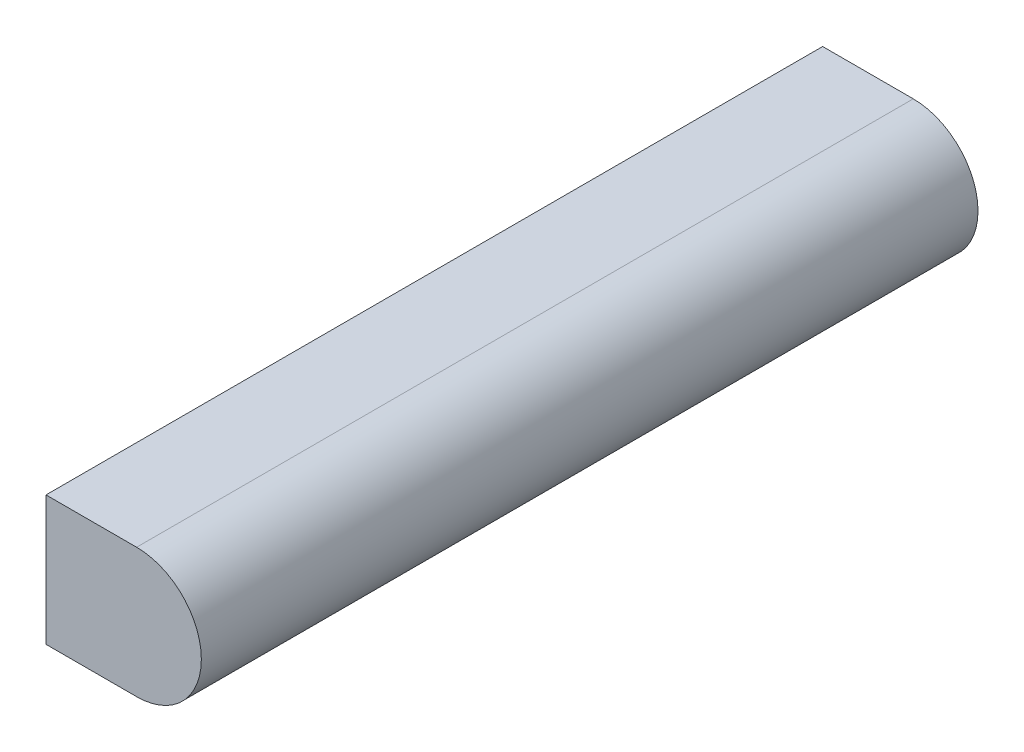
ISO-10303-21;
HEADER;
FILE_DESCRIPTION(('STEP AP214'),'2;1');
FILE_NAME('part.step','',(''),(''),'','','');
FILE_SCHEMA(('AUTOMOTIVE_DESIGN { 1 0 10303 214 1 1 1 1 }'));
ENDSEC;
DATA;
#1=APPLICATION_CONTEXT('core data for automotive mechanical design processes');
#2=APPLICATION_PROTOCOL_DEFINITION('international standard','automotive_design',2000,#1);
#3=PRODUCT_CONTEXT('',#1,'mechanical');
#4=PRODUCT('Part','Part','',(#3));
#5=PRODUCT_RELATED_PRODUCT_CATEGORY('part','',(#4));
#6=PRODUCT_DEFINITION_FORMATION('','',#4);
#7=PRODUCT_DEFINITION_CONTEXT('part definition',#1,'design');
#8=PRODUCT_DEFINITION('design','',#6,#7);
#9=PRODUCT_DEFINITION_SHAPE('','',#8);
#10=(LENGTH_UNIT() NAMED_UNIT(*) SI_UNIT(.MILLI.,.METRE.));
#11=(NAMED_UNIT(*) PLANE_ANGLE_UNIT() SI_UNIT($,.RADIAN.));
#12=(NAMED_UNIT(*) SI_UNIT($,.STERADIAN.) SOLID_ANGLE_UNIT());
#13=UNCERTAINTY_MEASURE_WITH_UNIT(LENGTH_MEASURE(1.E-05),#10,'distance_accuracy_value','');
#14=(GEOMETRIC_REPRESENTATION_CONTEXT(3) GLOBAL_UNCERTAINTY_ASSIGNED_CONTEXT((#13)) GLOBAL_UNIT_ASSIGNED_CONTEXT((#10,
#11,#12)) REPRESENTATION_CONTEXT('',''));
#15=CARTESIAN_POINT('',(0.,0.,0.));
#16=DIRECTION('',(0.,0.,1.));
#17=DIRECTION('',(1.,0.,0.));
#18=AXIS2_PLACEMENT_3D('',#15,#16,#17);
#19=CARTESIAN_POINT('',(3.175,3.17600000000064,0.));
#20=DIRECTION('',(-0.999999950399905,-0.000314960614369364,0.));
#21=DIRECTION('',(0.000314960614369364,-0.999999950399905,0.));
#22=AXIS2_PLACEMENT_3D('',#19,#20,#21);
#23=PLANE('',#22);
#24=DIRECTION('',(0.000314960614369364,-0.999999950399905,0.));
#25=VECTOR('',#24,1.);
#26=CARTESIAN_POINT('',(3.175,3.17600000000064,38.1));
#27=LINE('',#26,#25);
#28=CARTESIAN_POINT('',(3.175,3.17600000000064,38.1));
#29=VERTEX_POINT('',#28);
#30=CARTESIAN_POINT('',(3.17700000000044,-3.17399999999937,38.1));
#31=VERTEX_POINT('',#30);
#32=EDGE_CURVE('E107',#29,#31,#27,.T.);
#33=ORIENTED_EDGE('',*,*,#32,.F.);
#34=DIRECTION('',(0.,0.,1.));
#35=VECTOR('',#34,1.);
#36=CARTESIAN_POINT('',(3.175,3.17600000000064,0.));
#37=LINE('',#36,#35);
#38=CARTESIAN_POINT('',(3.175,3.17600000000064,0.));
#39=VERTEX_POINT('',#38);
#40=EDGE_CURVE('E11',#39,#29,#37,.T.);
#41=ORIENTED_EDGE('',*,*,#40,.F.);
#42=DIRECTION('',(0.000314960614369364,-0.999999950399905,0.));
#43=VECTOR('',#42,1.);
#44=CARTESIAN_POINT('',(3.175,3.17600000000064,0.));
#45=LINE('',#44,#43);
#46=CARTESIAN_POINT('',(3.17700000000044,-3.17399999999937,0.));
#47=VERTEX_POINT('',#46);
#48=EDGE_CURVE('E98',#39,#47,#45,.T.);
#49=ORIENTED_EDGE('',*,*,#48,.T.);
#50=DIRECTION('',(0.,0.,1.));
#51=VECTOR('',#50,1.);
#52=CARTESIAN_POINT('',(3.17700000000044,-3.17399999999937,0.));
#53=LINE('',#52,#51);
#54=EDGE_CURVE('E39',#47,#31,#53,.T.);
#55=ORIENTED_EDGE('',*,*,#54,.T.);
#56=EDGE_LOOP('',(#33,#41,#49,#55));
#57=FACE_BOUND('',#56,.T.);
#58=ADVANCED_FACE('F36',(#57),#23,.T.);
#59=CARTESIAN_POINT('',(3.175,3.17600000000064,0.));
#60=DIRECTION('',(0.,1.,0.));
#61=DIRECTION('',(0.,0.,1.));
#62=AXIS2_PLACEMENT_3D('',#59,#60,#61);
#63=PLANE('',#62);
#64=DIRECTION('',(-1.,0.,0.));
#65=VECTOR('',#64,1.);
#66=CARTESIAN_POINT('',(3.175,3.17600000000064,38.1));
#67=LINE('',#66,#65);
#68=CARTESIAN_POINT('',(7.62099999999846,3.17600000000064,38.1));
#69=VERTEX_POINT('',#68);
#70=EDGE_CURVE('E102',#69,#29,#67,.T.);
#71=ORIENTED_EDGE('',*,*,#70,.F.);
#72=DIRECTION('',(0.,0.,1.));
#73=VECTOR('',#72,1.);
#74=CARTESIAN_POINT('',(7.62099999999846,3.17600000000064,0.));
#75=LINE('',#74,#73);
#76=CARTESIAN_POINT('',(7.62099999999846,3.17600000000064,0.));
#77=VERTEX_POINT('',#76);
#78=EDGE_CURVE('E46',#77,#69,#75,.T.);
#79=ORIENTED_EDGE('',*,*,#78,.F.);
#80=DIRECTION('',(-1.,0.,0.));
#81=VECTOR('',#80,1.);
#82=CARTESIAN_POINT('',(3.175,3.17600000000064,0.));
#83=LINE('',#82,#81);
#84=EDGE_CURVE('E93',#77,#39,#83,.T.);
#85=ORIENTED_EDGE('',*,*,#84,.T.);
#86=ORIENTED_EDGE('',*,*,#40,.T.);
#87=EDGE_LOOP('',(#71,#79,#85,#86));
#88=FACE_BOUND('',#87,.T.);
#89=ADVANCED_FACE('F122',(#88),#63,.T.);
#90=CARTESIAN_POINT('',(7.62099999999923,0.00100000000063417,0.));
#91=DIRECTION('',(0.,0.,1.));
#92=DIRECTION('',(1.,0.,0.));
#93=AXIS2_PLACEMENT_3D('',#90,#91,#92);
#94=CYLINDRICAL_SURFACE('',#93,3.175);
#95=CARTESIAN_POINT('',(7.62099999999923,0.00100000000063417,38.1));
#96=DIRECTION('',(0.,0.,1.));
#97=DIRECTION('',(1.,0.,0.));
#98=AXIS2_PLACEMENT_3D('',#95,#96,#97);
#99=CIRCLE('',#98,3.175);
#100=CARTESIAN_POINT('',(7.62099999999999,-3.17399999999937,38.1));
#101=VERTEX_POINT('',#100);
#102=EDGE_CURVE('E87',#101,#69,#99,.T.);
#103=ORIENTED_EDGE('',*,*,#102,.F.);
#104=DIRECTION('',(0.,0.,1.));
#105=VECTOR('',#104,1.);
#106=CARTESIAN_POINT('',(7.62099999999999,-3.17399999999937,0.));
#107=LINE('',#106,#105);
#108=CARTESIAN_POINT('',(7.62099999999999,-3.17399999999937,0.));
#109=VERTEX_POINT('',#108);
#110=EDGE_CURVE('E82',#109,#101,#107,.T.);
#111=ORIENTED_EDGE('',*,*,#110,.F.);
#112=CARTESIAN_POINT('',(7.62099999999923,0.00100000000063417,0.));
#113=DIRECTION('',(0.,0.,1.));
#114=DIRECTION('',(1.,0.,0.));
#115=AXIS2_PLACEMENT_3D('',#112,#113,#114);
#116=CIRCLE('',#115,3.175);
#117=EDGE_CURVE('E85',#109,#77,#116,.T.);
#118=ORIENTED_EDGE('',*,*,#117,.T.);
#119=ORIENTED_EDGE('',*,*,#78,.T.);
#120=EDGE_LOOP('',(#103,#111,#118,#119));
#121=FACE_BOUND('',#120,.T.);
#122=ADVANCED_FACE('F84',(#121),#94,.T.);
#123=CARTESIAN_POINT('',(3.17700000000044,-3.17399999999937,0.));
#124=DIRECTION('',(0.,-1.,0.));
#125=DIRECTION('',(0.,0.,-1.));
#126=AXIS2_PLACEMENT_3D('',#123,#124,#125);
#127=PLANE('',#126);
#128=DIRECTION('',(1.,0.,0.));
#129=VECTOR('',#128,1.);
#130=CARTESIAN_POINT('',(3.17700000000044,-3.17399999999937,38.1));
#131=LINE('',#130,#129);
#132=EDGE_CURVE('E111',#31,#101,#131,.T.);
#133=ORIENTED_EDGE('',*,*,#132,.F.);
#134=ORIENTED_EDGE('',*,*,#54,.F.);
#135=DIRECTION('',(1.,0.,0.));
#136=VECTOR('',#135,1.);
#137=CARTESIAN_POINT('',(3.17700000000044,-3.17399999999937,0.));
#138=LINE('',#137,#136);
#139=EDGE_CURVE('E92',#47,#109,#138,.T.);
#140=ORIENTED_EDGE('',*,*,#139,.T.);
#141=ORIENTED_EDGE('',*,*,#110,.T.);
#142=EDGE_LOOP('',(#133,#134,#140,#141));
#143=FACE_BOUND('',#142,.T.);
#144=ADVANCED_FACE('F96',(#143),#127,.T.);
#145=CARTESIAN_POINT('',(7.62099999999923,0.00100000000063417,0.));
#146=DIRECTION('',(0.,0.,1.));
#147=DIRECTION('',(1.,0.,0.));
#148=AXIS2_PLACEMENT_3D('',#145,#146,#147);
#149=PLANE('',#148);
#150=ORIENTED_EDGE('',*,*,#48,.F.);
#151=ORIENTED_EDGE('',*,*,#84,.F.);
#152=ORIENTED_EDGE('',*,*,#117,.F.);
#153=ORIENTED_EDGE('',*,*,#139,.F.);
#154=EDGE_LOOP('',(#150,#151,#152,#153));
#155=FACE_BOUND('',#154,.T.);
#156=ADVANCED_FACE('F91',(#155),#149,.F.);
#157=CARTESIAN_POINT('',(7.62099999999923,0.00100000000063417,38.1));
#158=DIRECTION('',(0.,0.,1.));
#159=DIRECTION('',(1.,0.,0.));
#160=AXIS2_PLACEMENT_3D('',#157,#158,#159);
#161=PLANE('',#160);
#162=ORIENTED_EDGE('',*,*,#32,.T.);
#163=ORIENTED_EDGE('',*,*,#132,.T.);
#164=ORIENTED_EDGE('',*,*,#102,.T.);
#165=ORIENTED_EDGE('',*,*,#70,.T.);
#166=EDGE_LOOP('',(#162,#163,#164,#165));
#167=FACE_BOUND('',#166,.T.);
#168=ADVANCED_FACE('F121',(#167),#161,.T.);
#169=CLOSED_SHELL('',(#58,#89,#122,#144,#156,#168));
#170=MANIFOLD_SOLID_BREP('B2',#169);
#171=ADVANCED_BREP_SHAPE_REPRESENTATION('',(#18,#170),#14);
#172=SHAPE_DEFINITION_REPRESENTATION(#9,#171);
ENDSEC;
END-ISO-10303-21;
